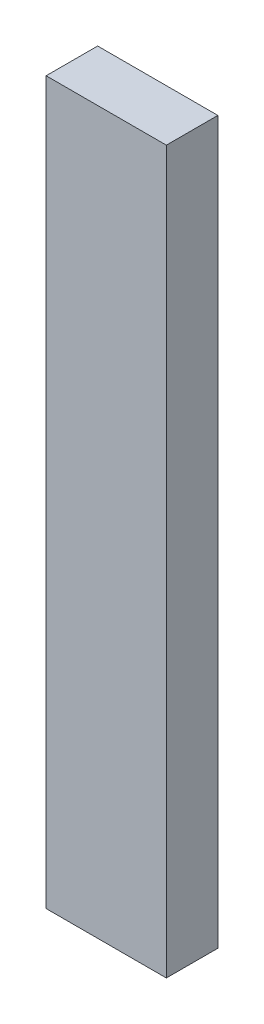
ISO-10303-21;
HEADER;
FILE_DESCRIPTION(('STEP AP214'),'2;1');
FILE_NAME('part.step','',(''),(''),'','','');
FILE_SCHEMA(('AUTOMOTIVE_DESIGN { 1 0 10303 214 1 1 1 1 }'));
ENDSEC;
DATA;
#1=APPLICATION_CONTEXT('core data for automotive mechanical design processes');
#2=APPLICATION_PROTOCOL_DEFINITION('international standard','automotive_design',2000,#1);
#3=PRODUCT_CONTEXT('',#1,'mechanical');
#4=PRODUCT('Part','Part','',(#3));
#5=PRODUCT_RELATED_PRODUCT_CATEGORY('part','',(#4));
#6=PRODUCT_DEFINITION_FORMATION('','',#4);
#7=PRODUCT_DEFINITION_CONTEXT('part definition',#1,'design');
#8=PRODUCT_DEFINITION('design','',#6,#7);
#9=PRODUCT_DEFINITION_SHAPE('','',#8);
#10=(LENGTH_UNIT() NAMED_UNIT(*) SI_UNIT(.MILLI.,.METRE.));
#11=(NAMED_UNIT(*) PLANE_ANGLE_UNIT() SI_UNIT($,.RADIAN.));
#12=(NAMED_UNIT(*) SI_UNIT($,.STERADIAN.) SOLID_ANGLE_UNIT());
#13=UNCERTAINTY_MEASURE_WITH_UNIT(LENGTH_MEASURE(1.E-05),#10,'distance_accuracy_value','');
#14=(GEOMETRIC_REPRESENTATION_CONTEXT(3) GLOBAL_UNCERTAINTY_ASSIGNED_CONTEXT((#13)) GLOBAL_UNIT_ASSIGNED_CONTEXT((#10,
#11,#12)) REPRESENTATION_CONTEXT('',''));
#15=CARTESIAN_POINT('',(0.,0.,0.));
#16=DIRECTION('',(0.,0.,1.));
#17=DIRECTION('',(1.,0.,0.));
#18=AXIS2_PLACEMENT_3D('',#15,#16,#17);
#19=CARTESIAN_POINT('',(-44.45,533.4,19.05));
#20=DIRECTION('',(-1.,0.,0.));
#21=DIRECTION('',(0.,0.,1.));
#22=AXIS2_PLACEMENT_3D('',#19,#20,#21);
#23=PLANE('',#22);
#24=DIRECTION('',(0.,0.,-1.));
#25=VECTOR('',#24,1.);
#26=CARTESIAN_POINT('',(-44.45,0.,19.05));
#27=LINE('',#26,#25);
#28=CARTESIAN_POINT('',(-44.45,0.,19.05));
#29=VERTEX_POINT('',#28);
#30=CARTESIAN_POINT('',(-44.45,0.,-19.05));
#31=VERTEX_POINT('',#30);
#32=EDGE_CURVE('E104',#29,#31,#27,.T.);
#33=ORIENTED_EDGE('',*,*,#32,.F.);
#34=DIRECTION('',(0.,-1.,0.));
#35=VECTOR('',#34,1.);
#36=CARTESIAN_POINT('',(-44.45,533.4,19.05));
#37=LINE('',#36,#35);
#38=CARTESIAN_POINT('',(-44.45,533.4,19.05));
#39=VERTEX_POINT('',#38);
#40=EDGE_CURVE('E11',#39,#29,#37,.T.);
#41=ORIENTED_EDGE('',*,*,#40,.F.);
#42=DIRECTION('',(0.,0.,-1.));
#43=VECTOR('',#42,1.);
#44=CARTESIAN_POINT('',(-44.45,533.4,19.05));
#45=LINE('',#44,#43);
#46=CARTESIAN_POINT('',(-44.45,533.4,-19.05));
#47=VERTEX_POINT('',#46);
#48=EDGE_CURVE('E99',#39,#47,#45,.T.);
#49=ORIENTED_EDGE('',*,*,#48,.T.);
#50=DIRECTION('',(0.,-1.,0.));
#51=VECTOR('',#50,1.);
#52=CARTESIAN_POINT('',(-44.45,533.4,-19.05));
#53=LINE('',#52,#51);
#54=EDGE_CURVE('E42',#47,#31,#53,.T.);
#55=ORIENTED_EDGE('',*,*,#54,.T.);
#56=EDGE_LOOP('',(#33,#41,#49,#55));
#57=FACE_BOUND('',#56,.T.);
#58=ADVANCED_FACE('F39',(#57),#23,.T.);
#59=CARTESIAN_POINT('',(-44.45,533.4,19.05));
#60=DIRECTION('',(0.,0.,-1.));
#61=DIRECTION('',(-1.,0.,0.));
#62=AXIS2_PLACEMENT_3D('',#59,#60,#61);
#63=PLANE('',#62);
#64=DIRECTION('',(1.,0.,0.));
#65=VECTOR('',#64,1.);
#66=CARTESIAN_POINT('',(-44.45,0.,19.05));
#67=LINE('',#66,#65);
#68=CARTESIAN_POINT('',(44.45,0.,19.05));
#69=VERTEX_POINT('',#68);
#70=EDGE_CURVE('E72',#29,#69,#67,.T.);
#71=ORIENTED_EDGE('',*,*,#70,.T.);
#72=DIRECTION('',(0.,-1.,0.));
#73=VECTOR('',#72,1.);
#74=CARTESIAN_POINT('',(44.45,533.4,19.05));
#75=LINE('',#74,#73);
#76=CARTESIAN_POINT('',(44.45,533.4,19.05));
#77=VERTEX_POINT('',#76);
#78=EDGE_CURVE('E48',#77,#69,#75,.T.);
#79=ORIENTED_EDGE('',*,*,#78,.F.);
#80=DIRECTION('',(1.,0.,0.));
#81=VECTOR('',#80,1.);
#82=CARTESIAN_POINT('',(-44.45,533.4,19.05));
#83=LINE('',#82,#81);
#84=EDGE_CURVE('E89',#39,#77,#83,.T.);
#85=ORIENTED_EDGE('',*,*,#84,.F.);
#86=ORIENTED_EDGE('',*,*,#40,.T.);
#87=EDGE_LOOP('',(#71,#79,#85,#86));
#88=FACE_BOUND('',#87,.T.);
#89=ADVANCED_FACE('F114',(#88),#63,.F.);
#90=CARTESIAN_POINT('',(44.45,533.4,19.05));
#91=DIRECTION('',(-1.,0.,0.));
#92=DIRECTION('',(0.,0.,1.));
#93=AXIS2_PLACEMENT_3D('',#90,#91,#92);
#94=PLANE('',#93);
#95=DIRECTION('',(0.,0.,-1.));
#96=VECTOR('',#95,1.);
#97=CARTESIAN_POINT('',(44.45,0.,19.05));
#98=LINE('',#97,#96);
#99=CARTESIAN_POINT('',(44.45,0.,-19.05));
#100=VERTEX_POINT('',#99);
#101=EDGE_CURVE('E96',#69,#100,#98,.T.);
#102=ORIENTED_EDGE('',*,*,#101,.T.);
#103=DIRECTION('',(0.,-1.,0.));
#104=VECTOR('',#103,1.);
#105=CARTESIAN_POINT('',(44.45,533.4,-19.05));
#106=LINE('',#105,#104);
#107=CARTESIAN_POINT('',(44.45,533.4,-19.05));
#108=VERTEX_POINT('',#107);
#109=EDGE_CURVE('E93',#108,#100,#106,.T.);
#110=ORIENTED_EDGE('',*,*,#109,.F.);
#111=DIRECTION('',(0.,0.,-1.));
#112=VECTOR('',#111,1.);
#113=CARTESIAN_POINT('',(44.45,533.4,19.05));
#114=LINE('',#113,#112);
#115=EDGE_CURVE('E84',#77,#108,#114,.T.);
#116=ORIENTED_EDGE('',*,*,#115,.F.);
#117=ORIENTED_EDGE('',*,*,#78,.T.);
#118=EDGE_LOOP('',(#102,#110,#116,#117));
#119=FACE_BOUND('',#118,.T.);
#120=ADVANCED_FACE('F94',(#119),#94,.F.);
#121=CARTESIAN_POINT('',(-44.45,533.4,-19.05));
#122=DIRECTION('',(0.,0.,-1.));
#123=DIRECTION('',(-1.,0.,0.));
#124=AXIS2_PLACEMENT_3D('',#121,#122,#123);
#125=PLANE('',#124);
#126=DIRECTION('',(1.,0.,0.));
#127=VECTOR('',#126,1.);
#128=CARTESIAN_POINT('',(-44.45,0.,-19.05));
#129=LINE('',#128,#127);
#130=EDGE_CURVE('E107',#31,#100,#129,.T.);
#131=ORIENTED_EDGE('',*,*,#130,.F.);
#132=ORIENTED_EDGE('',*,*,#54,.F.);
#133=DIRECTION('',(1.,0.,0.));
#134=VECTOR('',#133,1.);
#135=CARTESIAN_POINT('',(-44.45,533.4,-19.05));
#136=LINE('',#135,#134);
#137=EDGE_CURVE('E88',#47,#108,#136,.T.);
#138=ORIENTED_EDGE('',*,*,#137,.T.);
#139=ORIENTED_EDGE('',*,*,#109,.T.);
#140=EDGE_LOOP('',(#131,#132,#138,#139));
#141=FACE_BOUND('',#140,.T.);
#142=ADVANCED_FACE('F98',(#141),#125,.T.);
#143=CARTESIAN_POINT('',(0.,533.4,0.));
#144=DIRECTION('',(0.,-1.,0.));
#145=DIRECTION('',(0.,0.,-1.));
#146=AXIS2_PLACEMENT_3D('',#143,#144,#145);
#147=PLANE('',#146);
#148=ORIENTED_EDGE('',*,*,#48,.F.);
#149=ORIENTED_EDGE('',*,*,#84,.T.);
#150=ORIENTED_EDGE('',*,*,#115,.T.);
#151=ORIENTED_EDGE('',*,*,#137,.F.);
#152=EDGE_LOOP('',(#148,#149,#150,#151));
#153=FACE_BOUND('',#152,.T.);
#154=ADVANCED_FACE('F87',(#153),#147,.F.);
#155=CARTESIAN_POINT('',(0.,0.,0.));
#156=DIRECTION('',(0.,-1.,0.));
#157=DIRECTION('',(0.,0.,-1.));
#158=AXIS2_PLACEMENT_3D('',#155,#156,#157);
#159=PLANE('',#158);
#160=ORIENTED_EDGE('',*,*,#32,.T.);
#161=ORIENTED_EDGE('',*,*,#130,.T.);
#162=ORIENTED_EDGE('',*,*,#101,.F.);
#163=ORIENTED_EDGE('',*,*,#70,.F.);
#164=EDGE_LOOP('',(#160,#161,#162,#163));
#165=FACE_BOUND('',#164,.T.);
#166=ADVANCED_FACE('F112',(#165),#159,.T.);
#167=CLOSED_SHELL('',(#58,#89,#120,#142,#154,#166));
#168=MANIFOLD_SOLID_BREP('B2',#167);
#169=ADVANCED_BREP_SHAPE_REPRESENTATION('',(#18,#168),#14);
#170=SHAPE_DEFINITION_REPRESENTATION(#9,#169);
ENDSEC;
END-ISO-10303-21;
